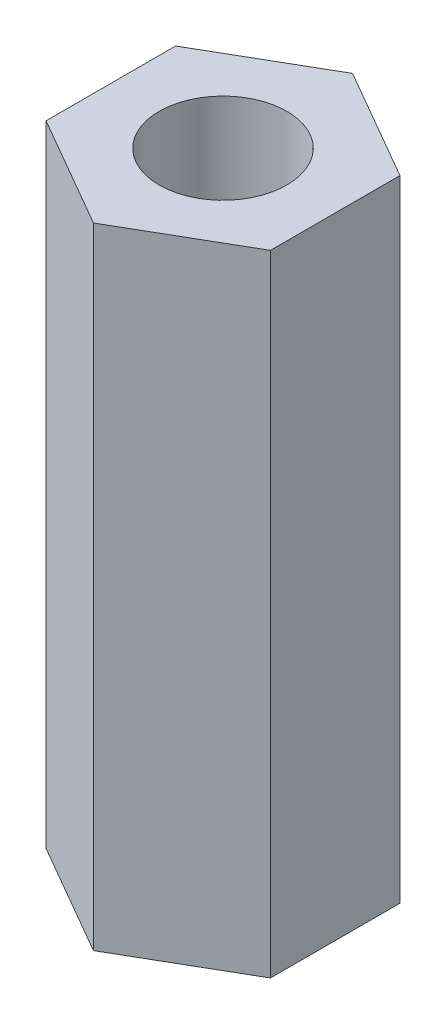
ISO-10303-21;
HEADER;
FILE_DESCRIPTION(('STEP AP214'),'2;1');
FILE_NAME('part.step','',(''),(''),'','','');
FILE_SCHEMA(('AUTOMOTIVE_DESIGN { 1 0 10303 214 1 1 1 1 }'));
ENDSEC;
DATA;
#1=APPLICATION_CONTEXT('core data for automotive mechanical design processes');
#2=APPLICATION_PROTOCOL_DEFINITION('international standard','automotive_design',2000,#1);
#3=PRODUCT_CONTEXT('',#1,'mechanical');
#4=PRODUCT('Part','Part','',(#3));
#5=PRODUCT_RELATED_PRODUCT_CATEGORY('part','',(#4));
#6=PRODUCT_DEFINITION_FORMATION('','',#4);
#7=PRODUCT_DEFINITION_CONTEXT('part definition',#1,'design');
#8=PRODUCT_DEFINITION('design','',#6,#7);
#9=PRODUCT_DEFINITION_SHAPE('','',#8);
#10=(LENGTH_UNIT() NAMED_UNIT(*) SI_UNIT(.MILLI.,.METRE.));
#11=(NAMED_UNIT(*) PLANE_ANGLE_UNIT() SI_UNIT($,.RADIAN.));
#12=(NAMED_UNIT(*) SI_UNIT($,.STERADIAN.) SOLID_ANGLE_UNIT());
#13=UNCERTAINTY_MEASURE_WITH_UNIT(LENGTH_MEASURE(1.E-05),#10,'distance_accuracy_value','');
#14=(GEOMETRIC_REPRESENTATION_CONTEXT(3) GLOBAL_UNCERTAINTY_ASSIGNED_CONTEXT((#13)) GLOBAL_UNIT_ASSIGNED_CONTEXT((#10,
#11,#12)) REPRESENTATION_CONTEXT('',''));
#15=CARTESIAN_POINT('',(0.,0.,0.));
#16=DIRECTION('',(0.,0.,1.));
#17=DIRECTION('',(1.,0.,0.));
#18=AXIS2_PLACEMENT_3D('',#15,#16,#17);
#19=CARTESIAN_POINT('',(0.,14.8,0.));
#20=DIRECTION('',(0.,1.,0.));
#21=DIRECTION('',(0.,0.,1.));
#22=AXIS2_PLACEMENT_3D('',#19,#20,#21);
#23=PLANE('',#22);
#24=DIRECTION('',(-0.866025403784439,0.,-0.5));
#25=VECTOR('',#24,1.);
#26=CARTESIAN_POINT('',(2.635,14.8,-1.52131795931467));
#27=LINE('',#26,#25);
#28=CARTESIAN_POINT('',(2.635,14.8,-1.52131795931467));
#29=VERTEX_POINT('',#28);
#30=CARTESIAN_POINT('',(0.,14.8,-3.04263591862933));
#31=VERTEX_POINT('',#30);
#32=EDGE_CURVE('E131',#29,#31,#27,.T.);
#33=ORIENTED_EDGE('',*,*,#32,.T.);
#34=DIRECTION('',(-0.866025403784439,0.,0.5));
#35=VECTOR('',#34,1.);
#36=CARTESIAN_POINT('',(0.,14.8,-3.04263591862933));
#37=LINE('',#36,#35);
#38=CARTESIAN_POINT('',(-2.635,14.8,-1.52131795931466));
#39=VERTEX_POINT('',#38);
#40=EDGE_CURVE('E89',#31,#39,#37,.T.);
#41=ORIENTED_EDGE('',*,*,#40,.T.);
#42=DIRECTION('',(0.,0.,1.));
#43=VECTOR('',#42,1.);
#44=CARTESIAN_POINT('',(-2.635,14.8,-1.52131795931466));
#45=LINE('',#44,#43);
#46=CARTESIAN_POINT('',(-2.635,14.8,1.52131795931466));
#47=VERTEX_POINT('',#46);
#48=EDGE_CURVE('E102',#39,#47,#45,.T.);
#49=ORIENTED_EDGE('',*,*,#48,.T.);
#50=DIRECTION('',(0.866025403784439,0.,0.5));
#51=VECTOR('',#50,1.);
#52=CARTESIAN_POINT('',(-2.635,14.8,1.52131795931466));
#53=LINE('',#52,#51);
#54=CARTESIAN_POINT('',(0.,14.8,3.04263591862933));
#55=VERTEX_POINT('',#54);
#56=EDGE_CURVE('E96',#47,#55,#53,.T.);
#57=ORIENTED_EDGE('',*,*,#56,.T.);
#58=DIRECTION('',(0.866025403784439,0.,-0.5));
#59=VECTOR('',#58,1.);
#60=CARTESIAN_POINT('',(0.,14.8,3.04263591862933));
#61=LINE('',#60,#59);
#62=CARTESIAN_POINT('',(2.635,14.8,1.52131795931466));
#63=VERTEX_POINT('',#62);
#64=EDGE_CURVE('E100',#55,#63,#61,.T.);
#65=ORIENTED_EDGE('',*,*,#64,.T.);
#66=DIRECTION('',(0.,0.,-1.));
#67=VECTOR('',#66,1.);
#68=CARTESIAN_POINT('',(2.635,14.8,1.52131795931466));
#69=LINE('',#68,#67);
#70=EDGE_CURVE('E52',#63,#29,#69,.T.);
#71=ORIENTED_EDGE('',*,*,#70,.T.);
#72=EDGE_LOOP('',(#33,#41,#49,#57,#65,#71));
#73=FACE_BOUND('',#72,.T.);
#74=CARTESIAN_POINT('',(0.,14.8,0.));
#75=DIRECTION('',(0.,1.,0.));
#76=DIRECTION('',(0.,0.,1.));
#77=AXIS2_PLACEMENT_3D('',#74,#75,#76);
#78=CIRCLE('',#77,1.5);
#79=CARTESIAN_POINT('',(0.,14.8,1.5));
#80=VERTEX_POINT('',#79);
#81=EDGE_CURVE('E124',#80,#80,#78,.T.);
#82=ORIENTED_EDGE('',*,*,#81,.F.);
#83=EDGE_LOOP('',(#82));
#84=FACE_BOUND('',#83,.T.);
#85=ADVANCED_FACE('F35',(#73,#84),#23,.T.);
#86=CARTESIAN_POINT('',(0.,0.,0.));
#87=DIRECTION('',(0.,1.,0.));
#88=DIRECTION('',(0.,0.,1.));
#89=AXIS2_PLACEMENT_3D('',#86,#87,#88);
#90=PLANE('',#89);
#91=DIRECTION('',(-0.866025403784439,0.,-0.5));
#92=VECTOR('',#91,1.);
#93=CARTESIAN_POINT('',(2.635,0.,-1.52131795931467));
#94=LINE('',#93,#92);
#95=CARTESIAN_POINT('',(2.635,0.,-1.52131795931467));
#96=VERTEX_POINT('',#95);
#97=CARTESIAN_POINT('',(0.,0.,-3.04263591862933));
#98=VERTEX_POINT('',#97);
#99=EDGE_CURVE('E120',#96,#98,#94,.T.);
#100=ORIENTED_EDGE('',*,*,#99,.F.);
#101=DIRECTION('',(0.,0.,-1.));
#102=VECTOR('',#101,1.);
#103=CARTESIAN_POINT('',(2.635,0.,1.52131795931466));
#104=LINE('',#103,#102);
#105=CARTESIAN_POINT('',(2.635,0.,1.52131795931466));
#106=VERTEX_POINT('',#105);
#107=EDGE_CURVE('E81',#106,#96,#104,.T.);
#108=ORIENTED_EDGE('',*,*,#107,.F.);
#109=DIRECTION('',(0.866025403784439,0.,-0.5));
#110=VECTOR('',#109,1.);
#111=CARTESIAN_POINT('',(0.,0.,3.04263591862933));
#112=LINE('',#111,#110);
#113=CARTESIAN_POINT('',(0.,0.,3.04263591862933));
#114=VERTEX_POINT('',#113);
#115=EDGE_CURVE('E75',#114,#106,#112,.T.);
#116=ORIENTED_EDGE('',*,*,#115,.F.);
#117=DIRECTION('',(0.866025403784439,0.,0.5));
#118=VECTOR('',#117,1.);
#119=CARTESIAN_POINT('',(-2.635,0.,1.52131795931466));
#120=LINE('',#119,#118);
#121=CARTESIAN_POINT('',(-2.635,0.,1.52131795931466));
#122=VERTEX_POINT('',#121);
#123=EDGE_CURVE('E110',#122,#114,#120,.T.);
#124=ORIENTED_EDGE('',*,*,#123,.F.);
#125=DIRECTION('',(0.,0.,1.));
#126=VECTOR('',#125,1.);
#127=CARTESIAN_POINT('',(-2.635,0.,-1.52131795931466));
#128=LINE('',#127,#126);
#129=CARTESIAN_POINT('',(-2.635,0.,-1.52131795931466));
#130=VERTEX_POINT('',#129);
#131=EDGE_CURVE('E126',#130,#122,#128,.T.);
#132=ORIENTED_EDGE('',*,*,#131,.F.);
#133=DIRECTION('',(-0.866025403784439,0.,0.5));
#134=VECTOR('',#133,1.);
#135=CARTESIAN_POINT('',(0.,0.,-3.04263591862933));
#136=LINE('',#135,#134);
#137=EDGE_CURVE('E123',#98,#130,#136,.T.);
#138=ORIENTED_EDGE('',*,*,#137,.F.);
#139=EDGE_LOOP('',(#100,#108,#116,#124,#132,#138));
#140=FACE_BOUND('',#139,.T.);
#141=CARTESIAN_POINT('',(0.,0.,0.));
#142=DIRECTION('',(0.,1.,0.));
#143=DIRECTION('',(0.,0.,1.));
#144=AXIS2_PLACEMENT_3D('',#141,#142,#143);
#145=CIRCLE('',#144,1.5);
#146=CARTESIAN_POINT('',(0.,0.,1.5));
#147=VERTEX_POINT('',#146);
#148=EDGE_CURVE('E224',#147,#147,#145,.T.);
#149=ORIENTED_EDGE('',*,*,#148,.T.);
#150=EDGE_LOOP('',(#149));
#151=FACE_BOUND('',#150,.T.);
#152=ADVANCED_FACE('F140',(#140,#151),#90,.F.);
#153=CARTESIAN_POINT('',(2.635,14.8,-1.52131795931467));
#154=DIRECTION('',(-0.5,0.,0.866025403784439));
#155=DIRECTION('',(0.866025403784439,0.,0.5));
#156=AXIS2_PLACEMENT_3D('',#153,#154,#155);
#157=PLANE('',#156);
#158=ORIENTED_EDGE('',*,*,#99,.T.);
#159=DIRECTION('',(0.,-1.,0.));
#160=VECTOR('',#159,1.);
#161=CARTESIAN_POINT('',(0.,14.8,-3.04263591862933));
#162=LINE('',#161,#160);
#163=EDGE_CURVE('E11',#31,#98,#162,.T.);
#164=ORIENTED_EDGE('',*,*,#163,.F.);
#165=ORIENTED_EDGE('',*,*,#32,.F.);
#166=DIRECTION('',(0.,-1.,0.));
#167=VECTOR('',#166,1.);
#168=CARTESIAN_POINT('',(2.635,14.8,-1.52131795931467));
#169=LINE('',#168,#167);
#170=EDGE_CURVE('E116',#29,#96,#169,.T.);
#171=ORIENTED_EDGE('',*,*,#170,.T.);
#172=EDGE_LOOP('',(#158,#164,#165,#171));
#173=FACE_BOUND('',#172,.T.);
#174=ADVANCED_FACE('F37',(#173),#157,.F.);
#175=CARTESIAN_POINT('',(0.,14.8,-3.04263591862933));
#176=DIRECTION('',(0.5,0.,0.866025403784439));
#177=DIRECTION('',(0.866025403784439,0.,-0.5));
#178=AXIS2_PLACEMENT_3D('',#175,#176,#177);
#179=PLANE('',#178);
#180=ORIENTED_EDGE('',*,*,#137,.T.);
#181=DIRECTION('',(0.,-1.,0.));
#182=VECTOR('',#181,1.);
#183=CARTESIAN_POINT('',(-2.635,14.8,-1.52131795931466));
#184=LINE('',#183,#182);
#185=EDGE_CURVE('E44',#39,#130,#184,.T.);
#186=ORIENTED_EDGE('',*,*,#185,.F.);
#187=ORIENTED_EDGE('',*,*,#40,.F.);
#188=ORIENTED_EDGE('',*,*,#163,.T.);
#189=EDGE_LOOP('',(#180,#186,#187,#188));
#190=FACE_BOUND('',#189,.T.);
#191=ADVANCED_FACE('F165',(#190),#179,.F.);
#192=CARTESIAN_POINT('',(-2.635,14.8,-1.52131795931466));
#193=DIRECTION('',(1.,0.,0.));
#194=DIRECTION('',(0.,0.,-1.));
#195=AXIS2_PLACEMENT_3D('',#192,#193,#194);
#196=PLANE('',#195);
#197=ORIENTED_EDGE('',*,*,#131,.T.);
#198=DIRECTION('',(0.,-1.,0.));
#199=VECTOR('',#198,1.);
#200=CARTESIAN_POINT('',(-2.635,14.8,1.52131795931466));
#201=LINE('',#200,#199);
#202=EDGE_CURVE('E111',#47,#122,#201,.T.);
#203=ORIENTED_EDGE('',*,*,#202,.F.);
#204=ORIENTED_EDGE('',*,*,#48,.F.);
#205=ORIENTED_EDGE('',*,*,#185,.T.);
#206=EDGE_LOOP('',(#197,#203,#204,#205));
#207=FACE_BOUND('',#206,.T.);
#208=ADVANCED_FACE('F137',(#207),#196,.F.);
#209=CARTESIAN_POINT('',(-2.635,14.8,1.52131795931466));
#210=DIRECTION('',(0.5,0.,-0.866025403784439));
#211=DIRECTION('',(-0.866025403784439,0.,-0.5));
#212=AXIS2_PLACEMENT_3D('',#209,#210,#211);
#213=PLANE('',#212);
#214=ORIENTED_EDGE('',*,*,#123,.T.);
#215=DIRECTION('',(0.,-1.,0.));
#216=VECTOR('',#215,1.);
#217=CARTESIAN_POINT('',(0.,14.8,3.04263591862933));
#218=LINE('',#217,#216);
#219=EDGE_CURVE('E107',#55,#114,#218,.T.);
#220=ORIENTED_EDGE('',*,*,#219,.F.);
#221=ORIENTED_EDGE('',*,*,#56,.F.);
#222=ORIENTED_EDGE('',*,*,#202,.T.);
#223=EDGE_LOOP('',(#214,#220,#221,#222));
#224=FACE_BOUND('',#223,.T.);
#225=ADVANCED_FACE('F108',(#224),#213,.F.);
#226=CARTESIAN_POINT('',(0.,14.8,3.04263591862933));
#227=DIRECTION('',(-0.5,0.,-0.866025403784439));
#228=DIRECTION('',(-0.866025403784439,0.,0.5));
#229=AXIS2_PLACEMENT_3D('',#226,#227,#228);
#230=PLANE('',#229);
#231=ORIENTED_EDGE('',*,*,#115,.T.);
#232=DIRECTION('',(0.,-1.,0.));
#233=VECTOR('',#232,1.);
#234=CARTESIAN_POINT('',(2.635,14.8,1.52131795931466));
#235=LINE('',#234,#233);
#236=EDGE_CURVE('E112',#63,#106,#235,.T.);
#237=ORIENTED_EDGE('',*,*,#236,.F.);
#238=ORIENTED_EDGE('',*,*,#64,.F.);
#239=ORIENTED_EDGE('',*,*,#219,.T.);
#240=EDGE_LOOP('',(#231,#237,#238,#239));
#241=FACE_BOUND('',#240,.T.);
#242=ADVANCED_FACE('F114',(#241),#230,.F.);
#243=CARTESIAN_POINT('',(2.635,14.8,1.52131795931466));
#244=DIRECTION('',(-1.,0.,0.));
#245=DIRECTION('',(0.,0.,1.));
#246=AXIS2_PLACEMENT_3D('',#243,#244,#245);
#247=PLANE('',#246);
#248=ORIENTED_EDGE('',*,*,#107,.T.);
#249=ORIENTED_EDGE('',*,*,#170,.F.);
#250=ORIENTED_EDGE('',*,*,#70,.F.);
#251=ORIENTED_EDGE('',*,*,#236,.T.);
#252=EDGE_LOOP('',(#248,#249,#250,#251));
#253=FACE_BOUND('',#252,.T.);
#254=ADVANCED_FACE('F145',(#253),#247,.F.);
#255=CARTESIAN_POINT('',(0.,14.8,0.));
#256=DIRECTION('',(0.,-1.,0.));
#257=DIRECTION('',(0.,0.,-1.));
#258=AXIS2_PLACEMENT_3D('',#255,#256,#257);
#259=CYLINDRICAL_SURFACE('',#258,1.5);
#260=ORIENTED_EDGE('',*,*,#81,.T.);
#261=EDGE_LOOP('',(#260));
#262=FACE_BOUND('',#261,.T.);
#263=ORIENTED_EDGE('',*,*,#148,.F.);
#264=EDGE_LOOP('',(#263));
#265=FACE_BOUND('',#264,.T.);
#266=ADVANCED_FACE('F147',(#262,#265),#259,.F.);
#267=CLOSED_SHELL('',(#85,#152,#174,#191,#208,#225,#242,#254,#266));
#268=MANIFOLD_SOLID_BREP('B2',#267);
#269=ADVANCED_BREP_SHAPE_REPRESENTATION('',(#18,#268),#14);
#270=SHAPE_DEFINITION_REPRESENTATION(#9,#269);
ENDSEC;
END-ISO-10303-21;
